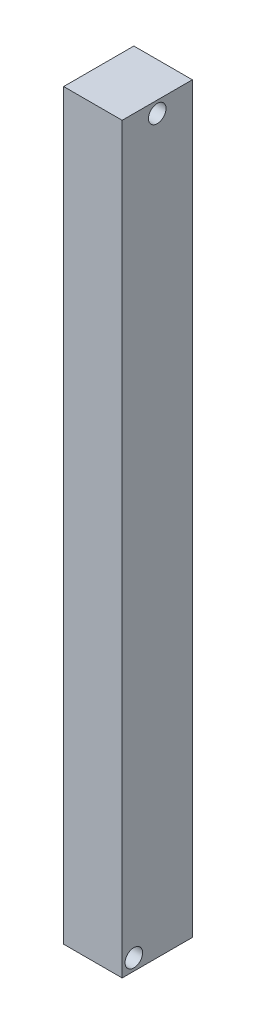
ISO-10303-21;
HEADER;
FILE_DESCRIPTION(('STEP AP214'),'2;1');
FILE_NAME('part.step','',(''),(''),'','','');
FILE_SCHEMA(('AUTOMOTIVE_DESIGN { 1 0 10303 214 1 1 1 1 }'));
ENDSEC;
DATA;
#1=APPLICATION_CONTEXT('core data for automotive mechanical design processes');
#2=APPLICATION_PROTOCOL_DEFINITION('international standard','automotive_design',2000,#1);
#3=PRODUCT_CONTEXT('',#1,'mechanical');
#4=PRODUCT('Part','Part','',(#3));
#5=PRODUCT_RELATED_PRODUCT_CATEGORY('part','',(#4));
#6=PRODUCT_DEFINITION_FORMATION('','',#4);
#7=PRODUCT_DEFINITION_CONTEXT('part definition',#1,'design');
#8=PRODUCT_DEFINITION('design','',#6,#7);
#9=PRODUCT_DEFINITION_SHAPE('','',#8);
#10=(LENGTH_UNIT() NAMED_UNIT(*) SI_UNIT(.MILLI.,.METRE.));
#11=(NAMED_UNIT(*) PLANE_ANGLE_UNIT() SI_UNIT($,.RADIAN.));
#12=(NAMED_UNIT(*) SI_UNIT($,.STERADIAN.) SOLID_ANGLE_UNIT());
#13=UNCERTAINTY_MEASURE_WITH_UNIT(LENGTH_MEASURE(1.E-05),#10,'distance_accuracy_value','');
#14=(GEOMETRIC_REPRESENTATION_CONTEXT(3) GLOBAL_UNCERTAINTY_ASSIGNED_CONTEXT((#13)) GLOBAL_UNIT_ASSIGNED_CONTEXT((#10,
#11,#12)) REPRESENTATION_CONTEXT('',''));
#15=CARTESIAN_POINT('',(0.,0.,0.));
#16=DIRECTION('',(0.,0.,1.));
#17=DIRECTION('',(1.,0.,0.));
#18=AXIS2_PLACEMENT_3D('',#15,#16,#17);
#19=CARTESIAN_POINT('',(0.,1612.9,0.));
#20=DIRECTION('',(1.,0.,0.));
#21=DIRECTION('',(0.,0.,-1.));
#22=AXIS2_PLACEMENT_3D('',#19,#20,#21);
#23=PLANE('',#22);
#24=CARTESIAN_POINT('',(0.,1587.5,-76.2));
#25=DIRECTION('',(1.,0.,0.));
#26=DIRECTION('',(0.,0.,-1.));
#27=AXIS2_PLACEMENT_3D('',#24,#25,#26);
#28=CIRCLE('',#27,19.05);
#29=CARTESIAN_POINT('',(0.,1587.5,-95.25));
#30=VERTEX_POINT('',#29);
#31=EDGE_CURVE('E115',#30,#30,#28,.T.);
#32=ORIENTED_EDGE('',*,*,#31,.T.);
#33=EDGE_LOOP('',(#32));
#34=FACE_BOUND('',#33,.T.);
#35=CARTESIAN_POINT('',(0.,25.4000000000001,-25.4));
#36=DIRECTION('',(1.,0.,0.));
#37=DIRECTION('',(0.,0.,-1.));
#38=AXIS2_PLACEMENT_3D('',#35,#36,#37);
#39=CIRCLE('',#38,19.05);
#40=CARTESIAN_POINT('',(0.,25.4000000000001,-44.45));
#41=VERTEX_POINT('',#40);
#42=EDGE_CURVE('E99',#41,#41,#39,.T.);
#43=ORIENTED_EDGE('',*,*,#42,.T.);
#44=EDGE_LOOP('',(#43));
#45=FACE_BOUND('',#44,.T.);
#46=DIRECTION('',(0.,0.,1.));
#47=VECTOR('',#46,1.);
#48=CARTESIAN_POINT('',(0.,0.,0.));
#49=LINE('',#48,#47);
#50=CARTESIAN_POINT('',(0.,0.,-152.4));
#51=VERTEX_POINT('',#50);
#52=CARTESIAN_POINT('',(0.,0.,0.));
#53=VERTEX_POINT('',#52);
#54=EDGE_CURVE('E96',#51,#53,#49,.T.);
#55=ORIENTED_EDGE('',*,*,#54,.T.);
#56=DIRECTION('',(0.,-1.,0.));
#57=VECTOR('',#56,1.);
#58=CARTESIAN_POINT('',(0.,1612.9,0.));
#59=LINE('',#58,#57);
#60=CARTESIAN_POINT('',(0.,1612.9,0.));
#61=VERTEX_POINT('',#60);
#62=EDGE_CURVE('E11',#61,#53,#59,.T.);
#63=ORIENTED_EDGE('',*,*,#62,.F.);
#64=DIRECTION('',(0.,0.,1.));
#65=VECTOR('',#64,1.);
#66=CARTESIAN_POINT('',(0.,1612.9,0.));
#67=LINE('',#66,#65);
#68=CARTESIAN_POINT('',(0.,1612.9,-152.4));
#69=VERTEX_POINT('',#68);
#70=EDGE_CURVE('E84',#69,#61,#67,.T.);
#71=ORIENTED_EDGE('',*,*,#70,.F.);
#72=DIRECTION('',(0.,-1.,0.));
#73=VECTOR('',#72,1.);
#74=CARTESIAN_POINT('',(0.,1612.9,-152.4));
#75=LINE('',#74,#73);
#76=EDGE_CURVE('E92',#69,#51,#75,.T.);
#77=ORIENTED_EDGE('',*,*,#76,.T.);
#78=EDGE_LOOP('',(#55,#63,#71,#77));
#79=FACE_BOUND('',#78,.T.);
#80=ADVANCED_FACE('F33',(#34,#45,#79),#23,.F.);
#81=CARTESIAN_POINT('',(0.,1612.9,0.));
#82=DIRECTION('',(0.,0.,-1.));
#83=DIRECTION('',(-1.,0.,0.));
#84=AXIS2_PLACEMENT_3D('',#81,#82,#83);
#85=PLANE('',#84);
#86=DIRECTION('',(1.,0.,0.));
#87=VECTOR('',#86,1.);
#88=CARTESIAN_POINT('',(0.,0.,0.));
#89=LINE('',#88,#87);
#90=CARTESIAN_POINT('',(127.,0.,0.));
#91=VERTEX_POINT('',#90);
#92=EDGE_CURVE('E88',#53,#91,#89,.T.);
#93=ORIENTED_EDGE('',*,*,#92,.T.);
#94=DIRECTION('',(0.,-1.,0.));
#95=VECTOR('',#94,1.);
#96=CARTESIAN_POINT('',(127.,1612.9,0.));
#97=LINE('',#96,#95);
#98=CARTESIAN_POINT('',(127.,1612.9,0.));
#99=VERTEX_POINT('',#98);
#100=EDGE_CURVE('E41',#99,#91,#97,.T.);
#101=ORIENTED_EDGE('',*,*,#100,.F.);
#102=DIRECTION('',(1.,0.,0.));
#103=VECTOR('',#102,1.);
#104=CARTESIAN_POINT('',(0.,1612.9,0.));
#105=LINE('',#104,#103);
#106=EDGE_CURVE('E79',#61,#99,#105,.T.);
#107=ORIENTED_EDGE('',*,*,#106,.F.);
#108=ORIENTED_EDGE('',*,*,#62,.T.);
#109=EDGE_LOOP('',(#93,#101,#107,#108));
#110=FACE_BOUND('',#109,.T.);
#111=ADVANCED_FACE('F87',(#110),#85,.F.);
#112=CARTESIAN_POINT('',(127.,1612.9,0.));
#113=DIRECTION('',(-1.,0.,0.));
#114=DIRECTION('',(0.,0.,1.));
#115=AXIS2_PLACEMENT_3D('',#112,#113,#114);
#116=PLANE('',#115);
#117=CARTESIAN_POINT('',(127.,1587.5,-76.2));
#118=DIRECTION('',(1.,0.,0.));
#119=DIRECTION('',(0.,0.,-1.));
#120=AXIS2_PLACEMENT_3D('',#117,#118,#119);
#121=CIRCLE('',#120,19.05);
#122=CARTESIAN_POINT('',(127.,1587.5,-95.25));
#123=VERTEX_POINT('',#122);
#124=EDGE_CURVE('E118',#123,#123,#121,.T.);
#125=ORIENTED_EDGE('',*,*,#124,.F.);
#126=EDGE_LOOP('',(#125));
#127=FACE_BOUND('',#126,.T.);
#128=CARTESIAN_POINT('',(127.,25.4000000000001,-25.4));
#129=DIRECTION('',(1.,0.,0.));
#130=DIRECTION('',(0.,0.,-1.));
#131=AXIS2_PLACEMENT_3D('',#128,#129,#130);
#132=CIRCLE('',#131,19.05);
#133=CARTESIAN_POINT('',(127.,25.4000000000001,-44.45));
#134=VERTEX_POINT('',#133);
#135=EDGE_CURVE('E112',#134,#134,#132,.T.);
#136=ORIENTED_EDGE('',*,*,#135,.F.);
#137=EDGE_LOOP('',(#136));
#138=FACE_BOUND('',#137,.T.);
#139=DIRECTION('',(0.,0.,-1.));
#140=VECTOR('',#139,1.);
#141=CARTESIAN_POINT('',(127.,0.,0.));
#142=LINE('',#141,#140);
#143=CARTESIAN_POINT('',(127.,0.,-152.4));
#144=VERTEX_POINT('',#143);
#145=EDGE_CURVE('E66',#91,#144,#142,.T.);
#146=ORIENTED_EDGE('',*,*,#145,.T.);
#147=DIRECTION('',(0.,-1.,0.));
#148=VECTOR('',#147,1.);
#149=CARTESIAN_POINT('',(127.,1612.9,-152.4));
#150=LINE('',#149,#148);
#151=CARTESIAN_POINT('',(127.,1612.9,-152.4));
#152=VERTEX_POINT('',#151);
#153=EDGE_CURVE('E89',#152,#144,#150,.T.);
#154=ORIENTED_EDGE('',*,*,#153,.F.);
#155=DIRECTION('',(0.,0.,-1.));
#156=VECTOR('',#155,1.);
#157=CARTESIAN_POINT('',(127.,1612.9,0.));
#158=LINE('',#157,#156);
#159=EDGE_CURVE('E82',#99,#152,#158,.T.);
#160=ORIENTED_EDGE('',*,*,#159,.F.);
#161=ORIENTED_EDGE('',*,*,#100,.T.);
#162=EDGE_LOOP('',(#146,#154,#160,#161));
#163=FACE_BOUND('',#162,.T.);
#164=ADVANCED_FACE('F90',(#127,#138,#163),#116,.F.);
#165=CARTESIAN_POINT('',(0.,1612.9,-152.4));
#166=DIRECTION('',(0.,0.,1.));
#167=DIRECTION('',(1.,0.,0.));
#168=AXIS2_PLACEMENT_3D('',#165,#166,#167);
#169=PLANE('',#168);
#170=DIRECTION('',(-1.,0.,0.));
#171=VECTOR('',#170,1.);
#172=CARTESIAN_POINT('',(0.,0.,-152.4));
#173=LINE('',#172,#171);
#174=EDGE_CURVE('E72',#144,#51,#173,.T.);
#175=ORIENTED_EDGE('',*,*,#174,.T.);
#176=ORIENTED_EDGE('',*,*,#76,.F.);
#177=DIRECTION('',(-1.,0.,0.));
#178=VECTOR('',#177,1.);
#179=CARTESIAN_POINT('',(0.,1612.9,-152.4));
#180=LINE('',#179,#178);
#181=EDGE_CURVE('E49',#152,#69,#180,.T.);
#182=ORIENTED_EDGE('',*,*,#181,.F.);
#183=ORIENTED_EDGE('',*,*,#153,.T.);
#184=EDGE_LOOP('',(#175,#176,#182,#183));
#185=FACE_BOUND('',#184,.T.);
#186=ADVANCED_FACE('F104',(#185),#169,.F.);
#187=CARTESIAN_POINT('',(0.,1612.9,0.));
#188=DIRECTION('',(0.,-1.,0.));
#189=DIRECTION('',(0.,0.,-1.));
#190=AXIS2_PLACEMENT_3D('',#187,#188,#189);
#191=PLANE('',#190);
#192=ORIENTED_EDGE('',*,*,#70,.T.);
#193=ORIENTED_EDGE('',*,*,#106,.T.);
#194=ORIENTED_EDGE('',*,*,#159,.T.);
#195=ORIENTED_EDGE('',*,*,#181,.T.);
#196=EDGE_LOOP('',(#192,#193,#194,#195));
#197=FACE_BOUND('',#196,.T.);
#198=ADVANCED_FACE('F80',(#197),#191,.F.);
#199=CARTESIAN_POINT('',(0.,0.,0.));
#200=DIRECTION('',(0.,-1.,0.));
#201=DIRECTION('',(0.,0.,-1.));
#202=AXIS2_PLACEMENT_3D('',#199,#200,#201);
#203=PLANE('',#202);
#204=ORIENTED_EDGE('',*,*,#54,.F.);
#205=ORIENTED_EDGE('',*,*,#174,.F.);
#206=ORIENTED_EDGE('',*,*,#145,.F.);
#207=ORIENTED_EDGE('',*,*,#92,.F.);
#208=EDGE_LOOP('',(#204,#205,#206,#207));
#209=FACE_BOUND('',#208,.T.);
#210=ADVANCED_FACE('F107',(#209),#203,.T.);
#211=CARTESIAN_POINT('',(-25.4,25.4000000000001,-25.4));
#212=DIRECTION('',(1.,0.,0.));
#213=DIRECTION('',(0.,0.,-1.));
#214=AXIS2_PLACEMENT_3D('',#211,#212,#213);
#215=CYLINDRICAL_SURFACE('',#214,19.05);
#216=ORIENTED_EDGE('',*,*,#135,.T.);
#217=EDGE_LOOP('',(#216));
#218=FACE_BOUND('',#217,.T.);
#219=ORIENTED_EDGE('',*,*,#42,.F.);
#220=EDGE_LOOP('',(#219));
#221=FACE_BOUND('',#220,.T.);
#222=ADVANCED_FACE('F130',(#218,#221),#215,.F.);
#223=CARTESIAN_POINT('',(-25.4,1587.5,-76.2));
#224=DIRECTION('',(1.,0.,0.));
#225=DIRECTION('',(0.,0.,-1.));
#226=AXIS2_PLACEMENT_3D('',#223,#224,#225);
#227=CYLINDRICAL_SURFACE('',#226,19.05);
#228=ORIENTED_EDGE('',*,*,#124,.T.);
#229=EDGE_LOOP('',(#228));
#230=FACE_BOUND('',#229,.T.);
#231=ORIENTED_EDGE('',*,*,#31,.F.);
#232=EDGE_LOOP('',(#231));
#233=FACE_BOUND('',#232,.T.);
#234=ADVANCED_FACE('F122',(#230,#233),#227,.F.);
#235=CLOSED_SHELL('',(#80,#111,#164,#186,#198,#210,#222,#234));
#236=MANIFOLD_SOLID_BREP('B2',#235);
#237=ADVANCED_BREP_SHAPE_REPRESENTATION('',(#18,#236),#14);
#238=SHAPE_DEFINITION_REPRESENTATION(#9,#237);
ENDSEC;
END-ISO-10303-21;
